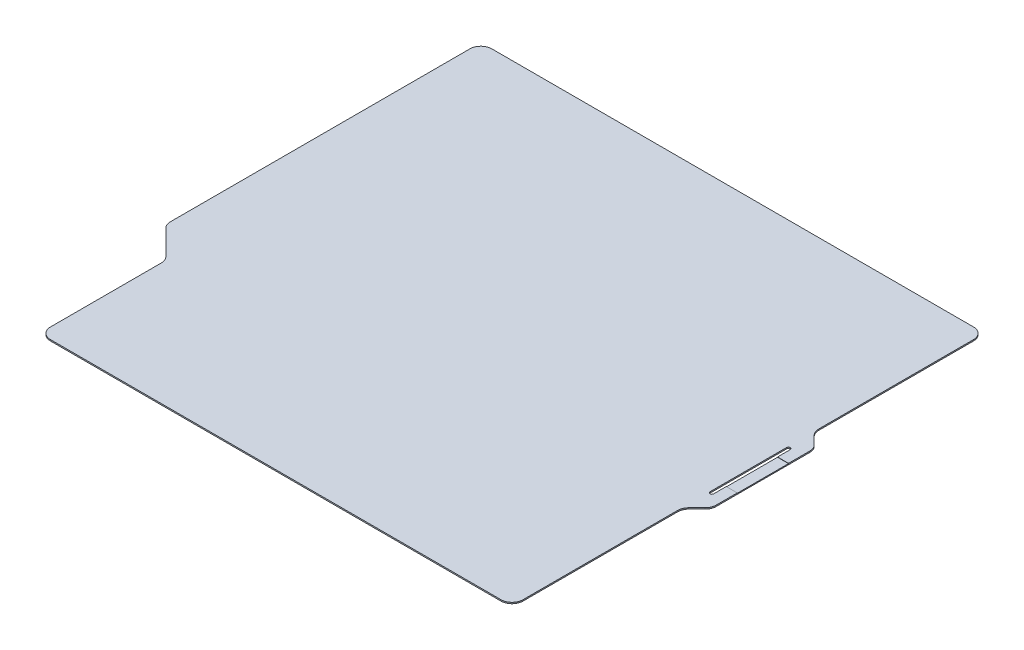
ISO-10303-21;
HEADER;
FILE_DESCRIPTION(('STEP AP214'),'2;1');
FILE_NAME('part.step','',(''),(''),'','','');
FILE_SCHEMA(('AUTOMOTIVE_DESIGN { 1 0 10303 214 1 1 1 1 }'));
ENDSEC;
DATA;
#1=APPLICATION_CONTEXT('core data for automotive mechanical design processes');
#2=APPLICATION_PROTOCOL_DEFINITION('international standard','automotive_design',2000,#1);
#3=PRODUCT_CONTEXT('',#1,'mechanical');
#4=PRODUCT('Part','Part','',(#3));
#5=PRODUCT_RELATED_PRODUCT_CATEGORY('part','',(#4));
#6=PRODUCT_DEFINITION_FORMATION('','',#4);
#7=PRODUCT_DEFINITION_CONTEXT('part definition',#1,'design');
#8=PRODUCT_DEFINITION('design','',#6,#7);
#9=PRODUCT_DEFINITION_SHAPE('','',#8);
#10=(LENGTH_UNIT() NAMED_UNIT(*) SI_UNIT(.MILLI.,.METRE.));
#11=(NAMED_UNIT(*) PLANE_ANGLE_UNIT() SI_UNIT($,.RADIAN.));
#12=(NAMED_UNIT(*) SI_UNIT($,.STERADIAN.) SOLID_ANGLE_UNIT());
#13=UNCERTAINTY_MEASURE_WITH_UNIT(LENGTH_MEASURE(1.E-05),#10,'distance_accuracy_value','');
#14=(GEOMETRIC_REPRESENTATION_CONTEXT(3) GLOBAL_UNCERTAINTY_ASSIGNED_CONTEXT((#13)) GLOBAL_UNIT_ASSIGNED_CONTEXT((#10,
#11,#12)) REPRESENTATION_CONTEXT('',''));
#15=CARTESIAN_POINT('',(0.,0.,0.));
#16=DIRECTION('',(0.,0.,1.));
#17=DIRECTION('',(1.,0.,0.));
#18=AXIS2_PLACEMENT_3D('',#15,#16,#17);
#19=CARTESIAN_POINT('',(82.4999999999993,0.69,82.5000000000002));
#20=DIRECTION('',(0.707106781186544,0.,0.707106781186551));
#21=DIRECTION('',(0.707106781186551,0.,-0.707106781186544));
#22=AXIS2_PLACEMENT_3D('',#19,#20,#21);
#23=PLANE('',#22);
#24=DIRECTION('',(-0.707106781186551,0.,0.707106781186544));
#25=VECTOR('',#24,1.);
#26=CARTESIAN_POINT('',(82.4999999999993,0.,82.5000000000002));
#27=LINE('',#26,#25);
#28=CARTESIAN_POINT('',(135.242640687119,0.,29.7573593128809));
#29=VERTEX_POINT('',#28);
#30=CARTESIAN_POINT('',(130.757359312881,0.,34.2426406871193));
#31=VERTEX_POINT('',#30);
#32=EDGE_CURVE('E260',#29,#31,#27,.T.);
#33=ORIENTED_EDGE('',*,*,#32,.F.);
#34=DIRECTION('',(0.,-1.,0.));
#35=VECTOR('',#34,1.);
#36=CARTESIAN_POINT('',(135.242640687119,0.69,29.7573593128809));
#37=LINE('',#36,#35);
#38=CARTESIAN_POINT('',(135.242640687119,0.69,29.7573593128809));
#39=VERTEX_POINT('',#38);
#40=EDGE_CURVE('E343',#29,#39,#37,.F.);
#41=ORIENTED_EDGE('',*,*,#40,.T.);
#42=DIRECTION('',(-0.707106781186551,0.,0.707106781186544));
#43=VECTOR('',#42,1.);
#44=CARTESIAN_POINT('',(82.4999999999993,0.69,82.5000000000002));
#45=LINE('',#44,#43);
#46=CARTESIAN_POINT('',(130.757359312881,0.69,34.2426406871193));
#47=VERTEX_POINT('',#46);
#48=EDGE_CURVE('E268',#39,#47,#45,.T.);
#49=ORIENTED_EDGE('',*,*,#48,.T.);
#50=DIRECTION('',(0.,-1.,0.));
#51=VECTOR('',#50,1.);
#52=CARTESIAN_POINT('',(130.757359312881,0.,34.2426406871193));
#53=LINE('',#52,#51);
#54=EDGE_CURVE('E340',#47,#31,#53,.T.);
#55=ORIENTED_EDGE('',*,*,#54,.T.);
#56=EDGE_LOOP('',(#33,#41,#49,#55));
#57=FACE_BOUND('',#56,.T.);
#58=ADVANCED_FACE('F35',(#57),#23,.T.);
#59=CARTESIAN_POINT('',(137.,0.69,0.));
#60=DIRECTION('',(1.,0.,0.));
#61=DIRECTION('',(0.,0.,-1.));
#62=AXIS2_PLACEMENT_3D('',#59,#60,#61);
#63=PLANE('',#62);
#64=DIRECTION('',(0.,0.,1.));
#65=VECTOR('',#64,1.);
#66=CARTESIAN_POINT('',(137.,0.69,0.));
#67=LINE('',#66,#65);
#68=CARTESIAN_POINT('',(137.,0.69,14.));
#69=VERTEX_POINT('',#68);
#70=CARTESIAN_POINT('',(137.,0.69,25.5147186257616));
#71=VERTEX_POINT('',#70);
#72=EDGE_CURVE('E241',#69,#71,#67,.T.);
#73=ORIENTED_EDGE('',*,*,#72,.T.);
#74=DIRECTION('',(0.,-1.,0.));
#75=VECTOR('',#74,1.);
#76=CARTESIAN_POINT('',(137.,0.69,25.5147186257616));
#77=LINE('',#76,#75);
#78=CARTESIAN_POINT('',(137.,0.,25.5147186257616));
#79=VERTEX_POINT('',#78);
#80=EDGE_CURVE('E323',#71,#79,#77,.T.);
#81=ORIENTED_EDGE('',*,*,#80,.T.);
#82=DIRECTION('',(0.,0.,1.));
#83=VECTOR('',#82,1.);
#84=CARTESIAN_POINT('',(137.,0.,0.));
#85=LINE('',#84,#83);
#86=CARTESIAN_POINT('',(137.,0.,-25.5147186257616));
#87=VERTEX_POINT('',#86);
#88=EDGE_CURVE('E298',#87,#79,#85,.T.);
#89=ORIENTED_EDGE('',*,*,#88,.F.);
#90=DIRECTION('',(0.,-1.,0.));
#91=VECTOR('',#90,1.);
#92=CARTESIAN_POINT('',(137.,0.69,-25.5147186257616));
#93=LINE('',#92,#91);
#94=CARTESIAN_POINT('',(137.,0.69,-25.5147186257616));
#95=VERTEX_POINT('',#94);
#96=EDGE_CURVE('E280',#87,#95,#93,.F.);
#97=ORIENTED_EDGE('',*,*,#96,.T.);
#98=CARTESIAN_POINT('',(137.,0.69,-14.));
#99=VERTEX_POINT('',#98);
#100=EDGE_CURVE('E272',#95,#99,#67,.T.);
#101=ORIENTED_EDGE('',*,*,#100,.T.);
#102=DIRECTION('',(0.,1.,0.));
#103=VECTOR('',#102,1.);
#104=CARTESIAN_POINT('',(137.,-28.6356421265527,-14.));
#105=LINE('',#104,#103);
#106=CARTESIAN_POINT('',(137.,0.549999999999998,-14.));
#107=VERTEX_POINT('',#106);
#108=EDGE_CURVE('E427',#107,#99,#105,.T.);
#109=ORIENTED_EDGE('',*,*,#108,.F.);
#110=DIRECTION('',(0.,0.,1.));
#111=VECTOR('',#110,1.);
#112=CARTESIAN_POINT('',(137.,0.549999999999998,-14.));
#113=LINE('',#112,#111);
#114=CARTESIAN_POINT('',(137.,0.549999999999998,14.));
#115=VERTEX_POINT('',#114);
#116=EDGE_CURVE('E426',#107,#115,#113,.T.);
#117=ORIENTED_EDGE('',*,*,#116,.T.);
#118=DIRECTION('',(0.,1.,0.));
#119=VECTOR('',#118,1.);
#120=CARTESIAN_POINT('',(137.,-28.6356421265527,14.));
#121=LINE('',#120,#119);
#122=EDGE_CURVE('E231',#115,#69,#121,.T.);
#123=ORIENTED_EDGE('',*,*,#122,.T.);
#124=EDGE_LOOP('',(#73,#81,#89,#97,#101,#109,#117,#123));
#125=FACE_BOUND('',#124,.T.);
#126=ADVANCED_FACE('F421',(#125),#63,.T.);
#127=CARTESIAN_POINT('',(82.4999999999993,0.69,-82.5000000000002));
#128=DIRECTION('',(-0.707106781186544,0.,0.707106781186551));
#129=DIRECTION('',(0.707106781186551,0.,0.707106781186544));
#130=AXIS2_PLACEMENT_3D('',#127,#128,#129);
#131=PLANE('',#130);
#132=DIRECTION('',(-0.707106781186551,0.,-0.707106781186544));
#133=VECTOR('',#132,1.);
#134=CARTESIAN_POINT('',(82.4999999999993,0.69,-82.5000000000002));
#135=LINE('',#134,#133);
#136=CARTESIAN_POINT('',(135.242640687119,0.69,-29.7573593128809));
#137=VERTEX_POINT('',#136);
#138=CARTESIAN_POINT('',(130.757359312881,0.69,-34.2426406871193));
#139=VERTEX_POINT('',#138);
#140=EDGE_CURVE('E274',#137,#139,#135,.T.);
#141=ORIENTED_EDGE('',*,*,#140,.F.);
#142=DIRECTION('',(0.,-1.,0.));
#143=VECTOR('',#142,1.);
#144=CARTESIAN_POINT('',(135.242640687119,0.,-29.7573593128809));
#145=LINE('',#144,#143);
#146=CARTESIAN_POINT('',(135.242640687119,0.,-29.7573593128809));
#147=VERTEX_POINT('',#146);
#148=EDGE_CURVE('E360',#137,#147,#145,.T.);
#149=ORIENTED_EDGE('',*,*,#148,.T.);
#150=DIRECTION('',(-0.707106781186551,0.,-0.707106781186544));
#151=VECTOR('',#150,1.);
#152=CARTESIAN_POINT('',(82.4999999999993,0.,-82.5000000000002));
#153=LINE('',#152,#151);
#154=CARTESIAN_POINT('',(130.757359312881,0.,-34.2426406871193));
#155=VERTEX_POINT('',#154);
#156=EDGE_CURVE('E301',#147,#155,#153,.T.);
#157=ORIENTED_EDGE('',*,*,#156,.T.);
#158=DIRECTION('',(0.,-1.,0.));
#159=VECTOR('',#158,1.);
#160=CARTESIAN_POINT('',(130.757359312881,0.69,-34.2426406871193));
#161=LINE('',#160,#159);
#162=EDGE_CURVE('E358',#155,#139,#161,.F.);
#163=ORIENTED_EDGE('',*,*,#162,.T.);
#164=EDGE_LOOP('',(#141,#149,#157,#163));
#165=FACE_BOUND('',#164,.T.);
#166=ADVANCED_FACE('F480',(#165),#131,.F.);
#167=CARTESIAN_POINT('',(129.,0.69,0.));
#168=DIRECTION('',(1.,0.,0.));
#169=DIRECTION('',(0.,0.,-1.));
#170=AXIS2_PLACEMENT_3D('',#167,#168,#169);
#171=PLANE('',#170);
#172=DIRECTION('',(0.,0.,1.));
#173=VECTOR('',#172,1.);
#174=CARTESIAN_POINT('',(129.,0.69,0.));
#175=LINE('',#174,#173);
#176=CARTESIAN_POINT('',(129.,0.69,-123.000000000001));
#177=VERTEX_POINT('',#176);
#178=CARTESIAN_POINT('',(129.,0.69,-38.4852813742386));
#179=VERTEX_POINT('',#178);
#180=EDGE_CURVE('E277',#177,#179,#175,.T.);
#181=ORIENTED_EDGE('',*,*,#180,.T.);
#182=DIRECTION('',(0.,-1.,0.));
#183=VECTOR('',#182,1.);
#184=CARTESIAN_POINT('',(129.,0.69,-38.4852813742386));
#185=LINE('',#184,#183);
#186=CARTESIAN_POINT('',(129.,0.,-38.4852813742386));
#187=VERTEX_POINT('',#186);
#188=EDGE_CURVE('E365',#179,#187,#185,.T.);
#189=ORIENTED_EDGE('',*,*,#188,.T.);
#190=DIRECTION('',(0.,0.,1.));
#191=VECTOR('',#190,1.);
#192=CARTESIAN_POINT('',(129.,0.,0.));
#193=LINE('',#192,#191);
#194=CARTESIAN_POINT('',(129.,0.,-123.000000000001));
#195=VERTEX_POINT('',#194);
#196=EDGE_CURVE('E304',#195,#187,#193,.T.);
#197=ORIENTED_EDGE('',*,*,#196,.F.);
#198=DIRECTION('',(0.,-1.,0.));
#199=VECTOR('',#198,1.);
#200=CARTESIAN_POINT('',(129.,0.69,-123.000000000001));
#201=LINE('',#200,#199);
#202=EDGE_CURVE('E363',#195,#177,#201,.F.);
#203=ORIENTED_EDGE('',*,*,#202,.T.);
#204=EDGE_LOOP('',(#181,#189,#197,#203));
#205=FACE_BOUND('',#204,.T.);
#206=ADVANCED_FACE('F489',(#205),#171,.T.);
#207=CARTESIAN_POINT('',(-4.21231676990133E-13,0.69,-129.));
#208=DIRECTION('',(0.,0.,1.));
#209=DIRECTION('',(1.,0.,0.));
#210=AXIS2_PLACEMENT_3D('',#207,#208,#209);
#211=PLANE('',#210);
#212=DIRECTION('',(-1.,0.,0.));
#213=VECTOR('',#212,1.);
#214=CARTESIAN_POINT('',(-4.21231676990133E-13,0.,-129.));
#215=LINE('',#214,#213);
#216=CARTESIAN_POINT('',(123.,0.,-129.000000000001));
#217=VERTEX_POINT('',#216);
#218=CARTESIAN_POINT('',(-140.,0.,-129.));
#219=VERTEX_POINT('',#218);
#220=EDGE_CURVE('E307',#217,#219,#215,.T.);
#221=ORIENTED_EDGE('',*,*,#220,.T.);
#222=DIRECTION('',(0.,-1.,0.));
#223=VECTOR('',#222,1.);
#224=CARTESIAN_POINT('',(-140.,0.69,-129.));
#225=LINE('',#224,#223);
#226=CARTESIAN_POINT('',(-140.,0.69,-129.));
#227=VERTEX_POINT('',#226);
#228=EDGE_CURVE('E376',#219,#227,#225,.F.);
#229=ORIENTED_EDGE('',*,*,#228,.T.);
#230=DIRECTION('',(-1.,0.,0.));
#231=VECTOR('',#230,1.);
#232=CARTESIAN_POINT('',(-4.21231676990133E-13,0.69,-129.));
#233=LINE('',#232,#231);
#234=CARTESIAN_POINT('',(123.,0.69,-129.000000000001));
#235=VERTEX_POINT('',#234);
#236=EDGE_CURVE('E282',#235,#227,#233,.T.);
#237=ORIENTED_EDGE('',*,*,#236,.F.);
#238=DIRECTION('',(0.,-1.,0.));
#239=VECTOR('',#238,1.);
#240=CARTESIAN_POINT('',(123.,0.,-129.000000000001));
#241=LINE('',#240,#239);
#242=EDGE_CURVE('E373',#235,#217,#241,.T.);
#243=ORIENTED_EDGE('',*,*,#242,.T.);
#244=EDGE_LOOP('',(#221,#229,#237,#243));
#245=FACE_BOUND('',#244,.T.);
#246=ADVANCED_FACE('F499',(#245),#211,.F.);
#247=CARTESIAN_POINT('',(-146.,0.69,0.));
#248=DIRECTION('',(1.,0.,0.));
#249=DIRECTION('',(0.,0.,-1.));
#250=AXIS2_PLACEMENT_3D('',#247,#248,#249);
#251=PLANE('',#250);
#252=DIRECTION('',(0.,0.,1.));
#253=VECTOR('',#252,1.);
#254=CARTESIAN_POINT('',(-146.,0.69,0.));
#255=LINE('',#254,#253);
#256=CARTESIAN_POINT('',(-146.,0.69,-123.));
#257=VERTEX_POINT('',#256);
#258=CARTESIAN_POINT('',(-146.,0.69,40.5147186257615));
#259=VERTEX_POINT('',#258);
#260=EDGE_CURVE('E285',#257,#259,#255,.T.);
#261=ORIENTED_EDGE('',*,*,#260,.F.);
#262=DIRECTION('',(0.,-1.,0.));
#263=VECTOR('',#262,1.);
#264=CARTESIAN_POINT('',(-146.,0.69,-123.));
#265=LINE('',#264,#263);
#266=CARTESIAN_POINT('',(-146.,0.,-123.));
#267=VERTEX_POINT('',#266);
#268=EDGE_CURVE('E370',#257,#267,#265,.T.);
#269=ORIENTED_EDGE('',*,*,#268,.T.);
#270=DIRECTION('',(0.,0.,1.));
#271=VECTOR('',#270,1.);
#272=CARTESIAN_POINT('',(-146.,0.,0.));
#273=LINE('',#272,#271);
#274=CARTESIAN_POINT('',(-146.,0.,40.5147186257615));
#275=VERTEX_POINT('',#274);
#276=EDGE_CURVE('E310',#267,#275,#273,.T.);
#277=ORIENTED_EDGE('',*,*,#276,.T.);
#278=DIRECTION('',(0.,-1.,0.));
#279=VECTOR('',#278,1.);
#280=CARTESIAN_POINT('',(-146.,0.69,40.5147186257615));
#281=LINE('',#280,#279);
#282=EDGE_CURVE('E368',#275,#259,#281,.F.);
#283=ORIENTED_EDGE('',*,*,#282,.T.);
#284=EDGE_LOOP('',(#261,#269,#277,#283));
#285=FACE_BOUND('',#284,.T.);
#286=ADVANCED_FACE('F508',(#285),#251,.F.);
#287=CARTESIAN_POINT('',(-94.4999999999992,0.69,94.5000000000003));
#288=DIRECTION('',(0.707106781186543,0.,-0.707106781186552));
#289=DIRECTION('',(-0.707106781186552,0.,-0.707106781186543));
#290=AXIS2_PLACEMENT_3D('',#287,#288,#289);
#291=PLANE('',#290);
#292=DIRECTION('',(0.707106781186552,0.,0.707106781186544));
#293=VECTOR('',#292,1.);
#294=CARTESIAN_POINT('',(-94.4999999999992,0.69,94.5000000000003));
#295=LINE('',#294,#293);
#296=CARTESIAN_POINT('',(-144.242640687119,0.69,44.7573593128808));
#297=VERTEX_POINT('',#296);
#298=CARTESIAN_POINT('',(-130.757359312881,0.69,58.2426406871191));
#299=VERTEX_POINT('',#298);
#300=EDGE_CURVE('E288',#297,#299,#295,.T.);
#301=ORIENTED_EDGE('',*,*,#300,.F.);
#302=DIRECTION('',(0.,-1.,0.));
#303=VECTOR('',#302,1.);
#304=CARTESIAN_POINT('',(-144.242640687119,0.69,44.7573593128808));
#305=LINE('',#304,#303);
#306=CARTESIAN_POINT('',(-144.242640687119,0.,44.7573593128808));
#307=VERTEX_POINT('',#306);
#308=EDGE_CURVE('E380',#297,#307,#305,.T.);
#309=ORIENTED_EDGE('',*,*,#308,.T.);
#310=DIRECTION('',(0.707106781186552,0.,0.707106781186544));
#311=VECTOR('',#310,1.);
#312=CARTESIAN_POINT('',(-94.4999999999992,0.,94.5000000000003));
#313=LINE('',#312,#311);
#314=CARTESIAN_POINT('',(-130.757359312881,0.,58.2426406871191));
#315=VERTEX_POINT('',#314);
#316=EDGE_CURVE('E313',#307,#315,#313,.T.);
#317=ORIENTED_EDGE('',*,*,#316,.T.);
#318=DIRECTION('',(0.,-1.,0.));
#319=VECTOR('',#318,1.);
#320=CARTESIAN_POINT('',(-130.757359312881,0.69,58.2426406871191));
#321=LINE('',#320,#319);
#322=EDGE_CURVE('E378',#315,#299,#321,.F.);
#323=ORIENTED_EDGE('',*,*,#322,.T.);
#324=EDGE_LOOP('',(#301,#309,#317,#323));
#325=FACE_BOUND('',#324,.T.);
#326=ADVANCED_FACE('F517',(#325),#291,.F.);
#327=CARTESIAN_POINT('',(-129.,0.69,0.));
#328=DIRECTION('',(1.,0.,0.));
#329=DIRECTION('',(0.,0.,-1.));
#330=AXIS2_PLACEMENT_3D('',#327,#328,#329);
#331=PLANE('',#330);
#332=DIRECTION('',(0.,0.,1.));
#333=VECTOR('',#332,1.);
#334=CARTESIAN_POINT('',(-129.,0.69,0.));
#335=LINE('',#334,#333);
#336=CARTESIAN_POINT('',(-129.,0.69,62.4852813742384));
#337=VERTEX_POINT('',#336);
#338=CARTESIAN_POINT('',(-129.,0.69,123.));
#339=VERTEX_POINT('',#338);
#340=EDGE_CURVE('E291',#337,#339,#335,.T.);
#341=ORIENTED_EDGE('',*,*,#340,.F.);
#342=DIRECTION('',(0.,-1.,0.));
#343=VECTOR('',#342,1.);
#344=CARTESIAN_POINT('',(-129.,0.,62.4852813742384));
#345=LINE('',#344,#343);
#346=CARTESIAN_POINT('',(-129.,0.,62.4852813742384));
#347=VERTEX_POINT('',#346);
#348=EDGE_CURVE('E385',#337,#347,#345,.T.);
#349=ORIENTED_EDGE('',*,*,#348,.T.);
#350=DIRECTION('',(0.,0.,1.));
#351=VECTOR('',#350,1.);
#352=CARTESIAN_POINT('',(-129.,0.,0.));
#353=LINE('',#352,#351);
#354=CARTESIAN_POINT('',(-129.,0.,123.));
#355=VERTEX_POINT('',#354);
#356=EDGE_CURVE('E316',#347,#355,#353,.T.);
#357=ORIENTED_EDGE('',*,*,#356,.T.);
#358=DIRECTION('',(0.,-1.,0.));
#359=VECTOR('',#358,1.);
#360=CARTESIAN_POINT('',(-129.,0.69,123.));
#361=LINE('',#360,#359);
#362=EDGE_CURVE('E383',#355,#339,#361,.F.);
#363=ORIENTED_EDGE('',*,*,#362,.T.);
#364=EDGE_LOOP('',(#341,#349,#357,#363));
#365=FACE_BOUND('',#364,.T.);
#366=ADVANCED_FACE('F526',(#365),#331,.F.);
#367=CARTESIAN_POINT('',(0.,0.69,129.));
#368=DIRECTION('',(0.,0.,1.));
#369=DIRECTION('',(1.,0.,0.));
#370=AXIS2_PLACEMENT_3D('',#367,#368,#369);
#371=PLANE('',#370);
#372=DIRECTION('',(-1.,0.,0.));
#373=VECTOR('',#372,1.);
#374=CARTESIAN_POINT('',(0.,0.69,129.));
#375=LINE('',#374,#373);
#376=CARTESIAN_POINT('',(123.,0.69,129.));
#377=VERTEX_POINT('',#376);
#378=CARTESIAN_POINT('',(-123.,0.69,129.));
#379=VERTEX_POINT('',#378);
#380=EDGE_CURVE('E281',#377,#379,#375,.T.);
#381=ORIENTED_EDGE('',*,*,#380,.T.);
#382=DIRECTION('',(0.,-1.,0.));
#383=VECTOR('',#382,1.);
#384=CARTESIAN_POINT('',(-123.,0.,129.));
#385=LINE('',#384,#383);
#386=CARTESIAN_POINT('',(-123.,0.,129.));
#387=VERTEX_POINT('',#386);
#388=EDGE_CURVE('E390',#379,#387,#385,.T.);
#389=ORIENTED_EDGE('',*,*,#388,.T.);
#390=DIRECTION('',(-1.,0.,0.));
#391=VECTOR('',#390,1.);
#392=CARTESIAN_POINT('',(0.,0.,129.));
#393=LINE('',#392,#391);
#394=CARTESIAN_POINT('',(123.,0.,129.));
#395=VERTEX_POINT('',#394);
#396=EDGE_CURVE('E319',#395,#387,#393,.T.);
#397=ORIENTED_EDGE('',*,*,#396,.F.);
#398=DIRECTION('',(0.,-1.,0.));
#399=VECTOR('',#398,1.);
#400=CARTESIAN_POINT('',(123.,0.69,129.));
#401=LINE('',#400,#399);
#402=EDGE_CURVE('E388',#395,#377,#401,.F.);
#403=ORIENTED_EDGE('',*,*,#402,.T.);
#404=EDGE_LOOP('',(#381,#389,#397,#403));
#405=FACE_BOUND('',#404,.T.);
#406=ADVANCED_FACE('F534',(#405),#371,.T.);
#407=CARTESIAN_POINT('',(129.,0.,38.4852813742386));
#408=VERTEX_POINT('',#407);
#409=CARTESIAN_POINT('',(129.,0.,123.));
#410=VERTEX_POINT('',#409);
#411=EDGE_CURVE('E271',#408,#410,#193,.T.);
#412=ORIENTED_EDGE('',*,*,#411,.F.);
#413=DIRECTION('',(0.,-1.,0.));
#414=VECTOR('',#413,1.);
#415=CARTESIAN_POINT('',(129.,0.69,38.4852813742386));
#416=LINE('',#415,#414);
#417=CARTESIAN_POINT('',(129.,0.69,38.4852813742386));
#418=VERTEX_POINT('',#417);
#419=EDGE_CURVE('E57',#408,#418,#416,.F.);
#420=ORIENTED_EDGE('',*,*,#419,.T.);
#421=CARTESIAN_POINT('',(129.,0.69,123.));
#422=VERTEX_POINT('',#421);
#423=EDGE_CURVE('E278',#418,#422,#175,.T.);
#424=ORIENTED_EDGE('',*,*,#423,.T.);
#425=DIRECTION('',(0.,-1.,0.));
#426=VECTOR('',#425,1.);
#427=CARTESIAN_POINT('',(129.,0.69,123.));
#428=LINE('',#427,#426);
#429=EDGE_CURVE('E393',#422,#410,#428,.T.);
#430=ORIENTED_EDGE('',*,*,#429,.T.);
#431=EDGE_LOOP('',(#412,#420,#424,#430));
#432=FACE_BOUND('',#431,.T.);
#433=ADVANCED_FACE('F410',(#432),#171,.T.);
#434=CARTESIAN_POINT('',(0.,0.69,0.));
#435=DIRECTION('',(0.,1.,0.));
#436=DIRECTION('',(0.,0.,1.));
#437=AXIS2_PLACEMENT_3D('',#434,#435,#436);
#438=PLANE('',#437);
#439=ORIENTED_EDGE('',*,*,#48,.F.);
#440=CARTESIAN_POINT('',(131.,0.69,25.5147186257616));
#441=DIRECTION('',(0.,1.,0.));
#442=DIRECTION('',(0.,0.,1.));
#443=AXIS2_PLACEMENT_3D('',#440,#441,#442);
#444=CIRCLE('',#443,6.);
#445=EDGE_CURVE('E356',#39,#71,#444,.T.);
#446=ORIENTED_EDGE('',*,*,#445,.T.);
#447=ORIENTED_EDGE('',*,*,#72,.F.);
#448=DIRECTION('',(1.,0.,0.));
#449=VECTOR('',#448,1.);
#450=CARTESIAN_POINT('',(131.,0.69,14.));
#451=LINE('',#450,#449);
#452=CARTESIAN_POINT('',(131.,0.69,14.));
#453=VERTEX_POINT('',#452);
#454=EDGE_CURVE('E223',#453,#69,#451,.T.);
#455=ORIENTED_EDGE('',*,*,#454,.F.);
#456=DIRECTION('',(0.,0.,-1.));
#457=VECTOR('',#456,1.);
#458=CARTESIAN_POINT('',(131.,0.69,-20.875));
#459=LINE('',#458,#457);
#460=CARTESIAN_POINT('',(131.,0.69,20.875));
#461=VERTEX_POINT('',#460);
#462=EDGE_CURVE('E239',#461,#453,#459,.T.);
#463=ORIENTED_EDGE('',*,*,#462,.F.);
#464=CARTESIAN_POINT('',(130.,0.69,20.875));
#465=DIRECTION('',(0.,1.,0.));
#466=DIRECTION('',(0.,0.,1.));
#467=AXIS2_PLACEMENT_3D('',#464,#465,#466);
#468=CIRCLE('',#467,1.);
#469=CARTESIAN_POINT('',(129.,0.69,20.875));
#470=VERTEX_POINT('',#469);
#471=EDGE_CURVE('E253',#470,#461,#468,.T.);
#472=ORIENTED_EDGE('',*,*,#471,.F.);
#473=DIRECTION('',(0.,0.,1.));
#474=VECTOR('',#473,1.);
#475=CARTESIAN_POINT('',(129.,0.69,-20.875));
#476=LINE('',#475,#474);
#477=CARTESIAN_POINT('',(129.,0.69,-20.875));
#478=VERTEX_POINT('',#477);
#479=EDGE_CURVE('E444',#478,#470,#476,.T.);
#480=ORIENTED_EDGE('',*,*,#479,.F.);
#481=CARTESIAN_POINT('',(130.,0.69,-20.875));
#482=DIRECTION('',(0.,1.,0.));
#483=DIRECTION('',(0.,0.,1.));
#484=AXIS2_PLACEMENT_3D('',#481,#482,#483);
#485=CIRCLE('',#484,1.);
#486=CARTESIAN_POINT('',(131.,0.69,-20.875));
#487=VERTEX_POINT('',#486);
#488=EDGE_CURVE('E434',#487,#478,#485,.T.);
#489=ORIENTED_EDGE('',*,*,#488,.F.);
#490=CARTESIAN_POINT('',(131.,0.69,-14.));
#491=VERTEX_POINT('',#490);
#492=EDGE_CURVE('E248',#491,#487,#459,.T.);
#493=ORIENTED_EDGE('',*,*,#492,.F.);
#494=DIRECTION('',(-1.,0.,0.));
#495=VECTOR('',#494,1.);
#496=CARTESIAN_POINT('',(131.,0.69,-14.));
#497=LINE('',#496,#495);
#498=EDGE_CURVE('E232',#99,#491,#497,.T.);
#499=ORIENTED_EDGE('',*,*,#498,.F.);
#500=ORIENTED_EDGE('',*,*,#100,.F.);
#501=CARTESIAN_POINT('',(131.,0.69,-25.5147186257616));
#502=DIRECTION('',(0.,1.,0.));
#503=DIRECTION('',(0.,0.,1.));
#504=AXIS2_PLACEMENT_3D('',#501,#502,#503);
#505=CIRCLE('',#504,6.);
#506=EDGE_CURVE('E354',#95,#137,#505,.T.);
#507=ORIENTED_EDGE('',*,*,#506,.T.);
#508=ORIENTED_EDGE('',*,*,#140,.T.);
#509=CARTESIAN_POINT('',(135.,0.69,-38.4852813742386));
#510=DIRECTION('',(0.,1.,0.));
#511=DIRECTION('',(0.,0.,1.));
#512=AXIS2_PLACEMENT_3D('',#509,#510,#511);
#513=CIRCLE('',#512,6.);
#514=EDGE_CURVE('E399',#139,#179,#513,.F.);
#515=ORIENTED_EDGE('',*,*,#514,.T.);
#516=ORIENTED_EDGE('',*,*,#180,.F.);
#517=CARTESIAN_POINT('',(123.,0.69,-123.000000000001));
#518=DIRECTION('',(0.,1.,0.));
#519=DIRECTION('',(0.,0.,1.));
#520=AXIS2_PLACEMENT_3D('',#517,#518,#519);
#521=CIRCLE('',#520,6.);
#522=EDGE_CURVE('E346',#177,#235,#521,.T.);
#523=ORIENTED_EDGE('',*,*,#522,.T.);
#524=ORIENTED_EDGE('',*,*,#236,.T.);
#525=CARTESIAN_POINT('',(-140.,0.69,-123.));
#526=DIRECTION('',(0.,1.,0.));
#527=DIRECTION('',(0.,0.,1.));
#528=AXIS2_PLACEMENT_3D('',#525,#526,#527);
#529=CIRCLE('',#528,6.);
#530=EDGE_CURVE('E352',#227,#257,#529,.T.);
#531=ORIENTED_EDGE('',*,*,#530,.T.);
#532=ORIENTED_EDGE('',*,*,#260,.T.);
#533=CARTESIAN_POINT('',(-140.,0.69,40.5147186257615));
#534=DIRECTION('',(0.,1.,0.));
#535=DIRECTION('',(0.,0.,1.));
#536=AXIS2_PLACEMENT_3D('',#533,#534,#535);
#537=CIRCLE('',#536,6.);
#538=EDGE_CURVE('E350',#259,#297,#537,.T.);
#539=ORIENTED_EDGE('',*,*,#538,.T.);
#540=ORIENTED_EDGE('',*,*,#300,.T.);
#541=CARTESIAN_POINT('',(-135.,0.69,62.4852813742384));
#542=DIRECTION('',(0.,1.,0.));
#543=DIRECTION('',(0.,0.,1.));
#544=AXIS2_PLACEMENT_3D('',#541,#542,#543);
#545=CIRCLE('',#544,6.);
#546=EDGE_CURVE('E403',#299,#337,#545,.F.);
#547=ORIENTED_EDGE('',*,*,#546,.T.);
#548=ORIENTED_EDGE('',*,*,#340,.T.);
#549=CARTESIAN_POINT('',(-123.,0.69,123.));
#550=DIRECTION('',(0.,1.,0.));
#551=DIRECTION('',(0.,0.,1.));
#552=AXIS2_PLACEMENT_3D('',#549,#550,#551);
#553=CIRCLE('',#552,6.);
#554=EDGE_CURVE('E348',#339,#379,#553,.T.);
#555=ORIENTED_EDGE('',*,*,#554,.T.);
#556=ORIENTED_EDGE('',*,*,#380,.F.);
#557=CARTESIAN_POINT('',(123.,0.69,123.));
#558=DIRECTION('',(0.,1.,0.));
#559=DIRECTION('',(0.,0.,1.));
#560=AXIS2_PLACEMENT_3D('',#557,#558,#559);
#561=CIRCLE('',#560,6.);
#562=EDGE_CURVE('E50',#377,#422,#561,.T.);
#563=ORIENTED_EDGE('',*,*,#562,.T.);
#564=ORIENTED_EDGE('',*,*,#423,.F.);
#565=CARTESIAN_POINT('',(135.,0.69,38.4852813742386));
#566=DIRECTION('',(0.,1.,0.));
#567=DIRECTION('',(0.,0.,1.));
#568=AXIS2_PLACEMENT_3D('',#565,#566,#567);
#569=CIRCLE('',#568,6.);
#570=EDGE_CURVE('E12',#418,#47,#569,.F.);
#571=ORIENTED_EDGE('',*,*,#570,.T.);
#572=EDGE_LOOP('',(#439,#446,#447,#455,#463,#472,#480,#489,#493,#499,#500,#507,#508,#515,#516,
#523,#524,#531,#532,#539,#540,#547,#548,#555,#556,#563,#564,#571));
#573=FACE_BOUND('',#572,.T.);
#574=ADVANCED_FACE('F237',(#573),#438,.T.);
#575=CARTESIAN_POINT('',(0.,0.,0.));
#576=DIRECTION('',(0.,1.,0.));
#577=DIRECTION('',(0.,0.,1.));
#578=AXIS2_PLACEMENT_3D('',#575,#576,#577);
#579=PLANE('',#578);
#580=DIRECTION('',(0.,0.,-1.));
#581=VECTOR('',#580,1.);
#582=CARTESIAN_POINT('',(131.,0.,-20.875));
#583=LINE('',#582,#581);
#584=CARTESIAN_POINT('',(131.,0.,20.875));
#585=VERTEX_POINT('',#584);
#586=CARTESIAN_POINT('',(131.,0.,-20.875));
#587=VERTEX_POINT('',#586);
#588=EDGE_CURVE('E267',#585,#587,#583,.T.);
#589=ORIENTED_EDGE('',*,*,#588,.T.);
#590=CARTESIAN_POINT('',(130.,0.,-20.875));
#591=DIRECTION('',(0.,1.,0.));
#592=DIRECTION('',(0.,0.,1.));
#593=AXIS2_PLACEMENT_3D('',#590,#591,#592);
#594=CIRCLE('',#593,1.);
#595=CARTESIAN_POINT('',(129.,0.,-20.875));
#596=VERTEX_POINT('',#595);
#597=EDGE_CURVE('E247',#587,#596,#594,.T.);
#598=ORIENTED_EDGE('',*,*,#597,.T.);
#599=DIRECTION('',(0.,0.,1.));
#600=VECTOR('',#599,1.);
#601=CARTESIAN_POINT('',(129.,0.,-20.875));
#602=LINE('',#601,#600);
#603=CARTESIAN_POINT('',(129.,0.,20.875));
#604=VERTEX_POINT('',#603);
#605=EDGE_CURVE('E251',#596,#604,#602,.T.);
#606=ORIENTED_EDGE('',*,*,#605,.T.);
#607=CARTESIAN_POINT('',(130.,0.,20.875));
#608=DIRECTION('',(0.,1.,0.));
#609=DIRECTION('',(0.,0.,1.));
#610=AXIS2_PLACEMENT_3D('',#607,#608,#609);
#611=CIRCLE('',#610,1.);
#612=EDGE_CURVE('E439',#604,#585,#611,.T.);
#613=ORIENTED_EDGE('',*,*,#612,.T.);
#614=EDGE_LOOP('',(#589,#598,#606,#613));
#615=FACE_BOUND('',#614,.T.);
#616=ORIENTED_EDGE('',*,*,#88,.T.);
#617=CARTESIAN_POINT('',(131.,0.,25.5147186257616));
#618=DIRECTION('',(0.,1.,0.));
#619=DIRECTION('',(0.,0.,1.));
#620=AXIS2_PLACEMENT_3D('',#617,#618,#619);
#621=CIRCLE('',#620,6.);
#622=EDGE_CURVE('E338',#79,#29,#621,.F.);
#623=ORIENTED_EDGE('',*,*,#622,.T.);
#624=ORIENTED_EDGE('',*,*,#32,.T.);
#625=CARTESIAN_POINT('',(135.,0.,38.4852813742386));
#626=DIRECTION('',(0.,1.,0.));
#627=DIRECTION('',(0.,0.,1.));
#628=AXIS2_PLACEMENT_3D('',#625,#626,#627);
#629=CIRCLE('',#628,6.);
#630=EDGE_CURVE('E43',#31,#408,#629,.T.);
#631=ORIENTED_EDGE('',*,*,#630,.T.);
#632=ORIENTED_EDGE('',*,*,#411,.T.);
#633=CARTESIAN_POINT('',(123.,0.,123.));
#634=DIRECTION('',(0.,1.,0.));
#635=DIRECTION('',(0.,0.,1.));
#636=AXIS2_PLACEMENT_3D('',#633,#634,#635);
#637=CIRCLE('',#636,6.);
#638=EDGE_CURVE('E326',#410,#395,#637,.F.);
#639=ORIENTED_EDGE('',*,*,#638,.T.);
#640=ORIENTED_EDGE('',*,*,#396,.T.);
#641=CARTESIAN_POINT('',(-123.,0.,123.));
#642=DIRECTION('',(0.,1.,0.));
#643=DIRECTION('',(0.,0.,1.));
#644=AXIS2_PLACEMENT_3D('',#641,#642,#643);
#645=CIRCLE('',#644,6.);
#646=EDGE_CURVE('E330',#387,#355,#645,.F.);
#647=ORIENTED_EDGE('',*,*,#646,.T.);
#648=ORIENTED_EDGE('',*,*,#356,.F.);
#649=CARTESIAN_POINT('',(-135.,0.,62.4852813742384));
#650=DIRECTION('',(0.,1.,0.));
#651=DIRECTION('',(0.,0.,1.));
#652=AXIS2_PLACEMENT_3D('',#649,#650,#651);
#653=CIRCLE('',#652,6.);
#654=EDGE_CURVE('E401',#347,#315,#653,.T.);
#655=ORIENTED_EDGE('',*,*,#654,.T.);
#656=ORIENTED_EDGE('',*,*,#316,.F.);
#657=CARTESIAN_POINT('',(-140.,0.,40.5147186257615));
#658=DIRECTION('',(0.,1.,0.));
#659=DIRECTION('',(0.,0.,1.));
#660=AXIS2_PLACEMENT_3D('',#657,#658,#659);
#661=CIRCLE('',#660,6.);
#662=EDGE_CURVE('E332',#307,#275,#661,.F.);
#663=ORIENTED_EDGE('',*,*,#662,.T.);
#664=ORIENTED_EDGE('',*,*,#276,.F.);
#665=CARTESIAN_POINT('',(-140.,0.,-123.));
#666=DIRECTION('',(0.,1.,0.));
#667=DIRECTION('',(0.,0.,1.));
#668=AXIS2_PLACEMENT_3D('',#665,#666,#667);
#669=CIRCLE('',#668,6.);
#670=EDGE_CURVE('E334',#267,#219,#669,.F.);
#671=ORIENTED_EDGE('',*,*,#670,.T.);
#672=ORIENTED_EDGE('',*,*,#220,.F.);
#673=CARTESIAN_POINT('',(123.,0.,-123.000000000001));
#674=DIRECTION('',(0.,1.,0.));
#675=DIRECTION('',(0.,0.,1.));
#676=AXIS2_PLACEMENT_3D('',#673,#674,#675);
#677=CIRCLE('',#676,6.);
#678=EDGE_CURVE('E328',#217,#195,#677,.F.);
#679=ORIENTED_EDGE('',*,*,#678,.T.);
#680=ORIENTED_EDGE('',*,*,#196,.T.);
#681=CARTESIAN_POINT('',(135.,0.,-38.4852813742386));
#682=DIRECTION('',(0.,1.,0.));
#683=DIRECTION('',(0.,0.,1.));
#684=AXIS2_PLACEMENT_3D('',#681,#682,#683);
#685=CIRCLE('',#684,6.);
#686=EDGE_CURVE('E397',#187,#155,#685,.T.);
#687=ORIENTED_EDGE('',*,*,#686,.T.);
#688=ORIENTED_EDGE('',*,*,#156,.F.);
#689=CARTESIAN_POINT('',(131.,0.,-25.5147186257616));
#690=DIRECTION('',(0.,1.,0.));
#691=DIRECTION('',(0.,0.,1.));
#692=AXIS2_PLACEMENT_3D('',#689,#690,#691);
#693=CIRCLE('',#692,6.);
#694=EDGE_CURVE('E336',#147,#87,#693,.F.);
#695=ORIENTED_EDGE('',*,*,#694,.T.);
#696=EDGE_LOOP('',(#616,#623,#624,#631,#632,#639,#640,#647,#648,#655,#656,#663,#664,#671,#672,
#679,#680,#687,#688,#695));
#697=FACE_BOUND('',#696,.T.);
#698=ADVANCED_FACE('F406',(#615,#697),#579,.F.);
#699=CARTESIAN_POINT('',(130.,0.,-20.875));
#700=DIRECTION('',(0.,1.,0.));
#701=DIRECTION('',(0.,0.,1.));
#702=AXIS2_PLACEMENT_3D('',#699,#700,#701);
#703=CYLINDRICAL_SURFACE('',#702,1.);
#704=ORIENTED_EDGE('',*,*,#488,.T.);
#705=DIRECTION('',(0.,1.,0.));
#706=VECTOR('',#705,1.);
#707=CARTESIAN_POINT('',(129.,0.,-20.875));
#708=LINE('',#707,#706);
#709=EDGE_CURVE('E264',#596,#478,#708,.T.);
#710=ORIENTED_EDGE('',*,*,#709,.F.);
#711=ORIENTED_EDGE('',*,*,#597,.F.);
#712=DIRECTION('',(0.,1.,0.));
#713=VECTOR('',#712,1.);
#714=CARTESIAN_POINT('',(131.,0.,-20.875));
#715=LINE('',#714,#713);
#716=EDGE_CURVE('E257',#587,#487,#715,.T.);
#717=ORIENTED_EDGE('',*,*,#716,.T.);
#718=EDGE_LOOP('',(#704,#710,#711,#717));
#719=FACE_BOUND('',#718,.T.);
#720=ADVANCED_FACE('F455',(#719),#703,.F.);
#721=CARTESIAN_POINT('',(131.,0.,-20.875));
#722=DIRECTION('',(1.,0.,0.));
#723=DIRECTION('',(0.,0.,-1.));
#724=AXIS2_PLACEMENT_3D('',#721,#722,#723);
#725=PLANE('',#724);
#726=DIRECTION('',(0.,0.,-1.));
#727=VECTOR('',#726,1.);
#728=CARTESIAN_POINT('',(131.,0.549999999999998,-14.));
#729=LINE('',#728,#727);
#730=CARTESIAN_POINT('',(131.,0.549999999999998,14.));
#731=VERTEX_POINT('',#730);
#732=CARTESIAN_POINT('',(131.,0.55,-14.));
#733=VERTEX_POINT('',#732);
#734=EDGE_CURVE('E435',#731,#733,#729,.T.);
#735=ORIENTED_EDGE('',*,*,#734,.T.);
#736=DIRECTION('',(0.,1.,0.));
#737=VECTOR('',#736,1.);
#738=CARTESIAN_POINT('',(131.,-28.6356421265527,-14.));
#739=LINE('',#738,#737);
#740=EDGE_CURVE('E430',#733,#491,#739,.T.);
#741=ORIENTED_EDGE('',*,*,#740,.T.);
#742=ORIENTED_EDGE('',*,*,#492,.T.);
#743=ORIENTED_EDGE('',*,*,#716,.F.);
#744=ORIENTED_EDGE('',*,*,#588,.F.);
#745=DIRECTION('',(0.,1.,0.));
#746=VECTOR('',#745,1.);
#747=CARTESIAN_POINT('',(131.,0.,20.875));
#748=LINE('',#747,#746);
#749=EDGE_CURVE('E245',#585,#461,#748,.T.);
#750=ORIENTED_EDGE('',*,*,#749,.T.);
#751=ORIENTED_EDGE('',*,*,#462,.T.);
#752=DIRECTION('',(0.,1.,0.));
#753=VECTOR('',#752,1.);
#754=CARTESIAN_POINT('',(131.,-28.6356421265527,14.));
#755=LINE('',#754,#753);
#756=EDGE_CURVE('E220',#731,#453,#755,.T.);
#757=ORIENTED_EDGE('',*,*,#756,.F.);
#758=EDGE_LOOP('',(#735,#741,#742,#743,#744,#750,#751,#757));
#759=FACE_BOUND('',#758,.T.);
#760=ADVANCED_FACE('F243',(#759),#725,.F.);
#761=CARTESIAN_POINT('',(130.,0.,20.875));
#762=DIRECTION('',(0.,1.,0.));
#763=DIRECTION('',(0.,0.,1.));
#764=AXIS2_PLACEMENT_3D('',#761,#762,#763);
#765=CYLINDRICAL_SURFACE('',#764,1.);
#766=ORIENTED_EDGE('',*,*,#471,.T.);
#767=ORIENTED_EDGE('',*,*,#749,.F.);
#768=ORIENTED_EDGE('',*,*,#612,.F.);
#769=DIRECTION('',(0.,1.,0.));
#770=VECTOR('',#769,1.);
#771=CARTESIAN_POINT('',(129.,0.,20.875));
#772=LINE('',#771,#770);
#773=EDGE_CURVE('E262',#604,#470,#772,.T.);
#774=ORIENTED_EDGE('',*,*,#773,.T.);
#775=EDGE_LOOP('',(#766,#767,#768,#774));
#776=FACE_BOUND('',#775,.T.);
#777=ADVANCED_FACE('F450',(#776),#765,.F.);
#778=CARTESIAN_POINT('',(129.,0.,-20.875));
#779=DIRECTION('',(-1.,0.,0.));
#780=DIRECTION('',(0.,0.,1.));
#781=AXIS2_PLACEMENT_3D('',#778,#779,#780);
#782=PLANE('',#781);
#783=ORIENTED_EDGE('',*,*,#479,.T.);
#784=ORIENTED_EDGE('',*,*,#773,.F.);
#785=ORIENTED_EDGE('',*,*,#605,.F.);
#786=ORIENTED_EDGE('',*,*,#709,.T.);
#787=EDGE_LOOP('',(#783,#784,#785,#786));
#788=FACE_BOUND('',#787,.T.);
#789=ADVANCED_FACE('F458',(#788),#782,.F.);
#790=CARTESIAN_POINT('',(131.,-28.6356421265527,-14.));
#791=DIRECTION('',(0.,0.,-1.));
#792=DIRECTION('',(-1.,0.,0.));
#793=AXIS2_PLACEMENT_3D('',#790,#791,#792);
#794=PLANE('',#793);
#795=DIRECTION('',(1.,0.,0.));
#796=VECTOR('',#795,1.);
#797=CARTESIAN_POINT('',(131.,0.549999999999998,-14.));
#798=LINE('',#797,#796);
#799=EDGE_CURVE('E463',#733,#107,#798,.T.);
#800=ORIENTED_EDGE('',*,*,#799,.T.);
#801=ORIENTED_EDGE('',*,*,#108,.T.);
#802=ORIENTED_EDGE('',*,*,#498,.T.);
#803=ORIENTED_EDGE('',*,*,#740,.F.);
#804=EDGE_LOOP('',(#800,#801,#802,#803));
#805=FACE_BOUND('',#804,.T.);
#806=ADVANCED_FACE('F468',(#805),#794,.F.);
#807=CARTESIAN_POINT('',(131.,-28.6356421265527,14.));
#808=DIRECTION('',(0.,0.,1.));
#809=DIRECTION('',(1.,0.,0.));
#810=AXIS2_PLACEMENT_3D('',#807,#808,#809);
#811=PLANE('',#810);
#812=DIRECTION('',(-1.,0.,0.));
#813=VECTOR('',#812,1.);
#814=CARTESIAN_POINT('',(131.,0.549999999999998,14.));
#815=LINE('',#814,#813);
#816=EDGE_CURVE('E226',#115,#731,#815,.T.);
#817=ORIENTED_EDGE('',*,*,#816,.T.);
#818=ORIENTED_EDGE('',*,*,#756,.T.);
#819=ORIENTED_EDGE('',*,*,#454,.T.);
#820=ORIENTED_EDGE('',*,*,#122,.F.);
#821=EDGE_LOOP('',(#817,#818,#819,#820));
#822=FACE_BOUND('',#821,.T.);
#823=ADVANCED_FACE('F222',(#822),#811,.F.);
#824=CARTESIAN_POINT('',(0.,0.55,0.));
#825=DIRECTION('',(0.,1.,0.));
#826=DIRECTION('',(0.,0.,1.));
#827=AXIS2_PLACEMENT_3D('',#824,#825,#826);
#828=PLANE('',#827);
#829=ORIENTED_EDGE('',*,*,#734,.F.);
#830=ORIENTED_EDGE('',*,*,#816,.F.);
#831=ORIENTED_EDGE('',*,*,#116,.F.);
#832=ORIENTED_EDGE('',*,*,#799,.F.);
#833=EDGE_LOOP('',(#829,#830,#831,#832));
#834=FACE_BOUND('',#833,.T.);
#835=ADVANCED_FACE('F470',(#834),#828,.T.);
#836=CARTESIAN_POINT('',(131.,0.69,25.5147186257616));
#837=DIRECTION('',(0.,-1.,0.));
#838=DIRECTION('',(0.,0.,-1.));
#839=AXIS2_PLACEMENT_3D('',#836,#837,#838);
#840=CYLINDRICAL_SURFACE('',#839,6.);
#841=ORIENTED_EDGE('',*,*,#445,.F.);
#842=ORIENTED_EDGE('',*,*,#40,.F.);
#843=ORIENTED_EDGE('',*,*,#622,.F.);
#844=ORIENTED_EDGE('',*,*,#80,.F.);
#845=EDGE_LOOP('',(#841,#842,#843,#844));
#846=FACE_BOUND('',#845,.T.);
#847=ADVANCED_FACE('F418',(#846),#840,.T.);
#848=CARTESIAN_POINT('',(131.,0.69,-25.5147186257616));
#849=DIRECTION('',(0.,1.,0.));
#850=DIRECTION('',(0.,0.,1.));
#851=AXIS2_PLACEMENT_3D('',#848,#849,#850);
#852=CYLINDRICAL_SURFACE('',#851,6.);
#853=ORIENTED_EDGE('',*,*,#506,.F.);
#854=ORIENTED_EDGE('',*,*,#96,.F.);
#855=ORIENTED_EDGE('',*,*,#694,.F.);
#856=ORIENTED_EDGE('',*,*,#148,.F.);
#857=EDGE_LOOP('',(#853,#854,#855,#856));
#858=FACE_BOUND('',#857,.T.);
#859=ADVANCED_FACE('F477',(#858),#852,.T.);
#860=CARTESIAN_POINT('',(135.,0.69,-38.4852813742386));
#861=DIRECTION('',(0.,-1.,0.));
#862=DIRECTION('',(0.,0.,-1.));
#863=AXIS2_PLACEMENT_3D('',#860,#861,#862);
#864=CYLINDRICAL_SURFACE('',#863,6.);
#865=ORIENTED_EDGE('',*,*,#514,.F.);
#866=ORIENTED_EDGE('',*,*,#162,.F.);
#867=ORIENTED_EDGE('',*,*,#686,.F.);
#868=ORIENTED_EDGE('',*,*,#188,.F.);
#869=EDGE_LOOP('',(#865,#866,#867,#868));
#870=FACE_BOUND('',#869,.T.);
#871=ADVANCED_FACE('F486',(#870),#864,.F.);
#872=CARTESIAN_POINT('',(-140.,0.69,-123.));
#873=DIRECTION('',(0.,-1.,0.));
#874=DIRECTION('',(0.,0.,-1.));
#875=AXIS2_PLACEMENT_3D('',#872,#873,#874);
#876=CYLINDRICAL_SURFACE('',#875,6.);
#877=ORIENTED_EDGE('',*,*,#530,.F.);
#878=ORIENTED_EDGE('',*,*,#228,.F.);
#879=ORIENTED_EDGE('',*,*,#670,.F.);
#880=ORIENTED_EDGE('',*,*,#268,.F.);
#881=EDGE_LOOP('',(#877,#878,#879,#880));
#882=FACE_BOUND('',#881,.T.);
#883=ADVANCED_FACE('F505',(#882),#876,.T.);
#884=CARTESIAN_POINT('',(-140.,0.69,40.5147186257615));
#885=DIRECTION('',(0.,-1.,0.));
#886=DIRECTION('',(0.,0.,-1.));
#887=AXIS2_PLACEMENT_3D('',#884,#885,#886);
#888=CYLINDRICAL_SURFACE('',#887,6.);
#889=ORIENTED_EDGE('',*,*,#538,.F.);
#890=ORIENTED_EDGE('',*,*,#282,.F.);
#891=ORIENTED_EDGE('',*,*,#662,.F.);
#892=ORIENTED_EDGE('',*,*,#308,.F.);
#893=EDGE_LOOP('',(#889,#890,#891,#892));
#894=FACE_BOUND('',#893,.T.);
#895=ADVANCED_FACE('F514',(#894),#888,.T.);
#896=CARTESIAN_POINT('',(-135.,0.69,62.4852813742384));
#897=DIRECTION('',(0.,1.,0.));
#898=DIRECTION('',(0.,0.,1.));
#899=AXIS2_PLACEMENT_3D('',#896,#897,#898);
#900=CYLINDRICAL_SURFACE('',#899,6.);
#901=ORIENTED_EDGE('',*,*,#546,.F.);
#902=ORIENTED_EDGE('',*,*,#322,.F.);
#903=ORIENTED_EDGE('',*,*,#654,.F.);
#904=ORIENTED_EDGE('',*,*,#348,.F.);
#905=EDGE_LOOP('',(#901,#902,#903,#904));
#906=FACE_BOUND('',#905,.T.);
#907=ADVANCED_FACE('F523',(#906),#900,.F.);
#908=CARTESIAN_POINT('',(-123.,0.69,123.));
#909=DIRECTION('',(0.,1.,0.));
#910=DIRECTION('',(0.,0.,1.));
#911=AXIS2_PLACEMENT_3D('',#908,#909,#910);
#912=CYLINDRICAL_SURFACE('',#911,6.);
#913=ORIENTED_EDGE('',*,*,#554,.F.);
#914=ORIENTED_EDGE('',*,*,#362,.F.);
#915=ORIENTED_EDGE('',*,*,#646,.F.);
#916=ORIENTED_EDGE('',*,*,#388,.F.);
#917=EDGE_LOOP('',(#913,#914,#915,#916));
#918=FACE_BOUND('',#917,.T.);
#919=ADVANCED_FACE('F531',(#918),#912,.T.);
#920=CARTESIAN_POINT('',(135.,0.69,38.4852813742386));
#921=DIRECTION('',(0.,1.,0.));
#922=DIRECTION('',(0.,0.,1.));
#923=AXIS2_PLACEMENT_3D('',#920,#921,#922);
#924=CYLINDRICAL_SURFACE('',#923,6.);
#925=ORIENTED_EDGE('',*,*,#570,.F.);
#926=ORIENTED_EDGE('',*,*,#419,.F.);
#927=ORIENTED_EDGE('',*,*,#630,.F.);
#928=ORIENTED_EDGE('',*,*,#54,.F.);
#929=EDGE_LOOP('',(#925,#926,#927,#928));
#930=FACE_BOUND('',#929,.T.);
#931=ADVANCED_FACE('F413',(#930),#924,.F.);
#932=CARTESIAN_POINT('',(123.,0.69,-123.000000000001));
#933=DIRECTION('',(0.,1.,0.));
#934=DIRECTION('',(0.,0.,1.));
#935=AXIS2_PLACEMENT_3D('',#932,#933,#934);
#936=CYLINDRICAL_SURFACE('',#935,6.);
#937=ORIENTED_EDGE('',*,*,#522,.F.);
#938=ORIENTED_EDGE('',*,*,#202,.F.);
#939=ORIENTED_EDGE('',*,*,#678,.F.);
#940=ORIENTED_EDGE('',*,*,#242,.F.);
#941=EDGE_LOOP('',(#937,#938,#939,#940));
#942=FACE_BOUND('',#941,.T.);
#943=ADVANCED_FACE('F496',(#942),#936,.T.);
#944=CARTESIAN_POINT('',(123.,0.69,123.));
#945=DIRECTION('',(0.,-1.,0.));
#946=DIRECTION('',(0.,0.,-1.));
#947=AXIS2_PLACEMENT_3D('',#944,#945,#946);
#948=CYLINDRICAL_SURFACE('',#947,6.);
#949=ORIENTED_EDGE('',*,*,#562,.F.);
#950=ORIENTED_EDGE('',*,*,#402,.F.);
#951=ORIENTED_EDGE('',*,*,#638,.F.);
#952=ORIENTED_EDGE('',*,*,#429,.F.);
#953=EDGE_LOOP('',(#949,#950,#951,#952));
#954=FACE_BOUND('',#953,.T.);
#955=ADVANCED_FACE('F37',(#954),#948,.T.);
#956=CLOSED_SHELL('',(#58,#126,#166,#206,#246,#286,#326,#366,#406,#433,#574,#698,#720,#760,#777,
#789,#806,#823,#835,#847,#859,#871,#883,#895,#907,#919,#931,#943,#955));
#957=MANIFOLD_SOLID_BREP('B2',#956);
#958=ADVANCED_BREP_SHAPE_REPRESENTATION('',(#18,#957),#14);
#959=SHAPE_DEFINITION_REPRESENTATION(#9,#958);
ENDSEC;
END-ISO-10303-21;
